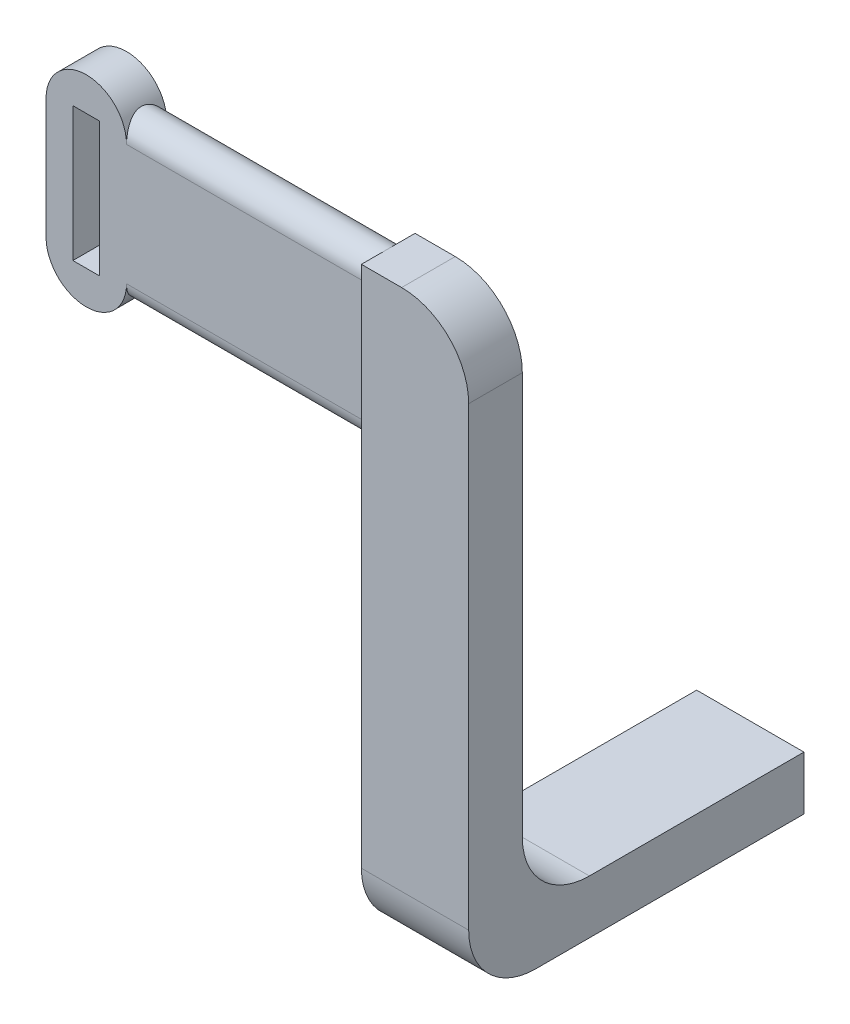
ISO-10303-21;
HEADER;
FILE_DESCRIPTION(('STEP AP214'),'2;1');
FILE_NAME('part.step','',(''),(''),'','','');
FILE_SCHEMA(('AUTOMOTIVE_DESIGN { 1 0 10303 214 1 1 1 1 }'));
ENDSEC;
DATA;
#1=APPLICATION_CONTEXT('core data for automotive mechanical design processes');
#2=APPLICATION_PROTOCOL_DEFINITION('international standard','automotive_design',2000,#1);
#3=PRODUCT_CONTEXT('',#1,'mechanical');
#4=PRODUCT('Part','Part','',(#3));
#5=PRODUCT_RELATED_PRODUCT_CATEGORY('part','',(#4));
#6=PRODUCT_DEFINITION_FORMATION('','',#4);
#7=PRODUCT_DEFINITION_CONTEXT('part definition',#1,'design');
#8=PRODUCT_DEFINITION('design','',#6,#7);
#9=PRODUCT_DEFINITION_SHAPE('','',#8);
#10=(LENGTH_UNIT() NAMED_UNIT(*) SI_UNIT(.MILLI.,.METRE.));
#11=(NAMED_UNIT(*) PLANE_ANGLE_UNIT() SI_UNIT($,.RADIAN.));
#12=(NAMED_UNIT(*) SI_UNIT($,.STERADIAN.) SOLID_ANGLE_UNIT());
#13=UNCERTAINTY_MEASURE_WITH_UNIT(LENGTH_MEASURE(1.E-05),#10,'distance_accuracy_value','');
#14=(GEOMETRIC_REPRESENTATION_CONTEXT(3) GLOBAL_UNCERTAINTY_ASSIGNED_CONTEXT((#13)) GLOBAL_UNIT_ASSIGNED_CONTEXT((#10,
#11,#12)) REPRESENTATION_CONTEXT('',''));
#15=CARTESIAN_POINT('',(0.,0.,0.));
#16=DIRECTION('',(0.,0.,1.));
#17=DIRECTION('',(1.,0.,0.));
#18=AXIS2_PLACEMENT_3D('',#15,#16,#17);
#19=CARTESIAN_POINT('',(-8.,-4.,50.));
#20=DIRECTION('',(0.,1.,0.));
#21=DIRECTION('',(0.,0.,1.));
#22=AXIS2_PLACEMENT_3D('',#19,#20,#21);
#23=PLANE('',#22);
#24=DIRECTION('',(0.,0.,-1.));
#25=VECTOR('',#24,1.);
#26=CARTESIAN_POINT('',(8.,-4.,50.));
#27=LINE('',#26,#25);
#28=CARTESIAN_POINT('',(8.,-4.,40.));
#29=VERTEX_POINT('',#28);
#30=CARTESIAN_POINT('',(8.,-4.,0.));
#31=VERTEX_POINT('',#30);
#32=EDGE_CURVE('E397',#29,#31,#27,.T.);
#33=ORIENTED_EDGE('',*,*,#32,.F.);
#34=DIRECTION('',(1.,0.,0.));
#35=VECTOR('',#34,1.);
#36=CARTESIAN_POINT('',(-8.,-4.,40.));
#37=LINE('',#36,#35);
#38=CARTESIAN_POINT('',(-8.,-4.,40.));
#39=VERTEX_POINT('',#38);
#40=EDGE_CURVE('E383',#29,#39,#37,.F.);
#41=ORIENTED_EDGE('',*,*,#40,.T.);
#42=DIRECTION('',(0.,0.,-1.));
#43=VECTOR('',#42,1.);
#44=CARTESIAN_POINT('',(-8.,-4.,50.));
#45=LINE('',#44,#43);
#46=CARTESIAN_POINT('',(-8.,-4.,0.));
#47=VERTEX_POINT('',#46);
#48=EDGE_CURVE('E394',#39,#47,#45,.T.);
#49=ORIENTED_EDGE('',*,*,#48,.T.);
#50=DIRECTION('',(1.,0.,0.));
#51=VECTOR('',#50,1.);
#52=CARTESIAN_POINT('',(-8.,-4.,0.));
#53=LINE('',#52,#51);
#54=CARTESIAN_POINT('',(-4.,-4.,0.));
#55=VERTEX_POINT('',#54);
#56=EDGE_CURVE('E416',#47,#55,#53,.T.);
#57=ORIENTED_EDGE('',*,*,#56,.T.);
#58=DIRECTION('',(0.,0.,1.));
#59=VECTOR('',#58,1.);
#60=CARTESIAN_POINT('',(-4.,-4.,0.));
#61=LINE('',#60,#59);
#62=CARTESIAN_POINT('',(-4.,-4.,25.));
#63=VERTEX_POINT('',#62);
#64=EDGE_CURVE('E454',#55,#63,#61,.T.);
#65=ORIENTED_EDGE('',*,*,#64,.T.);
#66=DIRECTION('',(1.,0.,0.));
#67=VECTOR('',#66,1.);
#68=CARTESIAN_POINT('',(-4.,-4.,25.));
#69=LINE('',#68,#67);
#70=CARTESIAN_POINT('',(4.,-4.,25.));
#71=VERTEX_POINT('',#70);
#72=EDGE_CURVE('E450',#63,#71,#69,.T.);
#73=ORIENTED_EDGE('',*,*,#72,.T.);
#74=DIRECTION('',(0.,0.,-1.));
#75=VECTOR('',#74,1.);
#76=CARTESIAN_POINT('',(4.,-4.,0.));
#77=LINE('',#76,#75);
#78=CARTESIAN_POINT('',(4.,-4.,0.));
#79=VERTEX_POINT('',#78);
#80=EDGE_CURVE('E445',#71,#79,#77,.T.);
#81=ORIENTED_EDGE('',*,*,#80,.T.);
#82=EDGE_CURVE('E420',#79,#31,#53,.T.);
#83=ORIENTED_EDGE('',*,*,#82,.T.);
#84=EDGE_LOOP('',(#33,#41,#49,#57,#65,#73,#81,#83));
#85=FACE_BOUND('',#84,.T.);
#86=ADVANCED_FACE('F38',(#85),#23,.F.);
#87=CARTESIAN_POINT('',(0.,0.,0.));
#88=DIRECTION('',(0.,0.,1.));
#89=DIRECTION('',(1.,0.,0.));
#90=AXIS2_PLACEMENT_3D('',#87,#88,#89);
#91=PLANE('',#90);
#92=DIRECTION('',(0.,-1.,0.));
#93=VECTOR('',#92,1.);
#94=CARTESIAN_POINT('',(-4.,1.,0.));
#95=LINE('',#94,#93);
#96=CARTESIAN_POINT('',(-4.,1.,0.));
#97=VERTEX_POINT('',#96);
#98=EDGE_CURVE('E440',#97,#55,#95,.T.);
#99=ORIENTED_EDGE('',*,*,#98,.T.);
#100=ORIENTED_EDGE('',*,*,#56,.F.);
#101=DIRECTION('',(0.,-1.,0.));
#102=VECTOR('',#101,1.);
#103=CARTESIAN_POINT('',(-8.,4.,0.));
#104=LINE('',#103,#102);
#105=CARTESIAN_POINT('',(-8.,4.,0.));
#106=VERTEX_POINT('',#105);
#107=EDGE_CURVE('E421',#106,#47,#104,.T.);
#108=ORIENTED_EDGE('',*,*,#107,.F.);
#109=DIRECTION('',(1.,0.,0.));
#110=VECTOR('',#109,1.);
#111=CARTESIAN_POINT('',(-8.,4.,0.));
#112=LINE('',#111,#110);
#113=CARTESIAN_POINT('',(8.,4.,0.));
#114=VERTEX_POINT('',#113);
#115=EDGE_CURVE('E407',#106,#114,#112,.T.);
#116=ORIENTED_EDGE('',*,*,#115,.T.);
#117=DIRECTION('',(0.,-1.,0.));
#118=VECTOR('',#117,1.);
#119=CARTESIAN_POINT('',(8.,4.,0.));
#120=LINE('',#119,#118);
#121=EDGE_CURVE('E412',#114,#31,#120,.T.);
#122=ORIENTED_EDGE('',*,*,#121,.T.);
#123=ORIENTED_EDGE('',*,*,#82,.F.);
#124=DIRECTION('',(0.,-1.,0.));
#125=VECTOR('',#124,1.);
#126=CARTESIAN_POINT('',(4.,1.,0.));
#127=LINE('',#126,#125);
#128=CARTESIAN_POINT('',(4.,1.,0.));
#129=VERTEX_POINT('',#128);
#130=EDGE_CURVE('E437',#129,#79,#127,.T.);
#131=ORIENTED_EDGE('',*,*,#130,.F.);
#132=DIRECTION('',(-1.,0.,0.));
#133=VECTOR('',#132,1.);
#134=CARTESIAN_POINT('',(-4.,1.,0.));
#135=LINE('',#134,#133);
#136=EDGE_CURVE('E444',#129,#97,#135,.T.);
#137=ORIENTED_EDGE('',*,*,#136,.T.);
#138=EDGE_LOOP('',(#99,#100,#108,#116,#122,#123,#131,#137));
#139=FACE_BOUND('',#138,.T.);
#140=ADVANCED_FACE('F325',(#139),#91,.F.);
#141=CARTESIAN_POINT('',(-8.,4.,50.));
#142=DIRECTION('',(1.,0.,0.));
#143=DIRECTION('',(0.,0.,-1.));
#144=AXIS2_PLACEMENT_3D('',#141,#142,#143);
#145=PLANE('',#144);
#146=ORIENTED_EDGE('',*,*,#48,.F.);
#147=CARTESIAN_POINT('',(-8.,6.,40.));
#148=DIRECTION('',(1.,0.,0.));
#149=DIRECTION('',(0.,0.,-1.));
#150=AXIS2_PLACEMENT_3D('',#147,#148,#149);
#151=CIRCLE('',#150,10.);
#152=CARTESIAN_POINT('',(-8.,6.,50.));
#153=VERTEX_POINT('',#152);
#154=EDGE_CURVE('E380',#39,#153,#151,.F.);
#155=ORIENTED_EDGE('',*,*,#154,.T.);
#156=DIRECTION('',(0.,-1.,0.));
#157=VECTOR('',#156,1.);
#158=CARTESIAN_POINT('',(-8.,4.,50.));
#159=LINE('',#158,#157);
#160=CARTESIAN_POINT('',(-8.,84.,50.));
#161=VERTEX_POINT('',#160);
#162=EDGE_CURVE('E411',#161,#153,#159,.T.);
#163=ORIENTED_EDGE('',*,*,#162,.F.);
#164=DIRECTION('',(0.,0.,1.));
#165=VECTOR('',#164,1.);
#166=CARTESIAN_POINT('',(-8.,84.,50.));
#167=LINE('',#166,#165);
#168=CARTESIAN_POINT('',(-8.,84.,46.0252352163252));
#169=VERTEX_POINT('',#168);
#170=EDGE_CURVE('E488',#169,#161,#167,.T.);
#171=ORIENTED_EDGE('',*,*,#170,.F.);
#172=CARTESIAN_POINT('',(-8.,81.,46.0252352163252));
#173=DIRECTION('',(1.,0.,0.));
#174=DIRECTION('',(0.,0.,-1.));
#175=AXIS2_PLACEMENT_3D('',#172,#173,#174);
#176=CIRCLE('',#175,3.);
#177=CARTESIAN_POINT('',(-8.,81.,49.0252352163252));
#178=VERTEX_POINT('',#177);
#179=EDGE_CURVE('E393',#169,#178,#176,.T.);
#180=ORIENTED_EDGE('',*,*,#179,.T.);
#181=DIRECTION('',(0.,-1.,0.));
#182=VECTOR('',#181,1.);
#183=CARTESIAN_POINT('',(-8.,81.,49.0252352163252));
#184=LINE('',#183,#182);
#185=CARTESIAN_POINT('',(-8.,63.,49.0252352163252));
#186=VERTEX_POINT('',#185);
#187=EDGE_CURVE('E509',#178,#186,#184,.T.);
#188=ORIENTED_EDGE('',*,*,#187,.T.);
#189=CARTESIAN_POINT('',(-8.,63.,46.0252352163252));
#190=DIRECTION('',(1.,0.,0.));
#191=DIRECTION('',(0.,0.,-1.));
#192=AXIS2_PLACEMENT_3D('',#189,#190,#191);
#193=CIRCLE('',#192,3.);
#194=CARTESIAN_POINT('',(-8.,63.,43.0252352163252));
#195=VERTEX_POINT('',#194);
#196=EDGE_CURVE('E505',#186,#195,#193,.T.);
#197=ORIENTED_EDGE('',*,*,#196,.T.);
#198=DIRECTION('',(0.,1.,0.));
#199=VECTOR('',#198,1.);
#200=CARTESIAN_POINT('',(-8.,81.,43.0252352163252));
#201=LINE('',#200,#199);
#202=CARTESIAN_POINT('',(-8.,81.,43.0252352163252));
#203=VERTEX_POINT('',#202);
#204=EDGE_CURVE('E493',#195,#203,#201,.T.);
#205=ORIENTED_EDGE('',*,*,#204,.T.);
#206=EDGE_CURVE('E512',#203,#169,#176,.T.);
#207=ORIENTED_EDGE('',*,*,#206,.T.);
#208=CARTESIAN_POINT('',(-8.,84.,42.));
#209=VERTEX_POINT('',#208);
#210=EDGE_CURVE('E484',#209,#169,#167,.T.);
#211=ORIENTED_EDGE('',*,*,#210,.F.);
#212=DIRECTION('',(0.,-1.,0.));
#213=VECTOR('',#212,1.);
#214=CARTESIAN_POINT('',(-8.,84.,42.));
#215=LINE('',#214,#213);
#216=CARTESIAN_POINT('',(-8.,14.,42.));
#217=VERTEX_POINT('',#216);
#218=EDGE_CURVE('E473',#209,#217,#215,.T.);
#219=ORIENTED_EDGE('',*,*,#218,.T.);
#220=CARTESIAN_POINT('',(-8.,14.,32.));
#221=DIRECTION('',(1.,0.,0.));
#222=DIRECTION('',(0.,0.,-1.));
#223=AXIS2_PLACEMENT_3D('',#220,#221,#222);
#224=CIRCLE('',#223,10.);
#225=CARTESIAN_POINT('',(-8.,4.,32.));
#226=VERTEX_POINT('',#225);
#227=EDGE_CURVE('E365',#217,#226,#224,.T.);
#228=ORIENTED_EDGE('',*,*,#227,.T.);
#229=DIRECTION('',(0.,0.,-1.));
#230=VECTOR('',#229,1.);
#231=CARTESIAN_POINT('',(-8.,4.,50.));
#232=LINE('',#231,#230);
#233=EDGE_CURVE('E403',#226,#106,#232,.T.);
#234=ORIENTED_EDGE('',*,*,#233,.T.);
#235=ORIENTED_EDGE('',*,*,#107,.T.);
#236=EDGE_LOOP('',(#146,#155,#163,#171,#180,#188,#197,#205,#207,#211,#219,#228,#234,#235));
#237=FACE_BOUND('',#236,.T.);
#238=ADVANCED_FACE('F333',(#237),#145,.F.);
#239=CARTESIAN_POINT('',(8.,4.,50.));
#240=DIRECTION('',(1.,0.,0.));
#241=DIRECTION('',(0.,0.,-1.));
#242=AXIS2_PLACEMENT_3D('',#239,#240,#241);
#243=PLANE('',#242);
#244=DIRECTION('',(0.,-1.,0.));
#245=VECTOR('',#244,1.);
#246=CARTESIAN_POINT('',(8.,84.,42.));
#247=LINE('',#246,#245);
#248=CARTESIAN_POINT('',(8.,74.,42.));
#249=VERTEX_POINT('',#248);
#250=CARTESIAN_POINT('',(8.,14.,42.));
#251=VERTEX_POINT('',#250);
#252=EDGE_CURVE('E458',#249,#251,#247,.T.);
#253=ORIENTED_EDGE('',*,*,#252,.F.);
#254=DIRECTION('',(0.,0.,-1.));
#255=VECTOR('',#254,1.);
#256=CARTESIAN_POINT('',(8.,74.,50.));
#257=LINE('',#256,#255);
#258=CARTESIAN_POINT('',(8.,74.,50.));
#259=VERTEX_POINT('',#258);
#260=EDGE_CURVE('E47',#249,#259,#257,.F.);
#261=ORIENTED_EDGE('',*,*,#260,.T.);
#262=DIRECTION('',(0.,-1.,0.));
#263=VECTOR('',#262,1.);
#264=CARTESIAN_POINT('',(8.,4.,50.));
#265=LINE('',#264,#263);
#266=CARTESIAN_POINT('',(8.,6.,50.));
#267=VERTEX_POINT('',#266);
#268=EDGE_CURVE('E406',#259,#267,#265,.T.);
#269=ORIENTED_EDGE('',*,*,#268,.T.);
#270=CARTESIAN_POINT('',(8.,6.,40.));
#271=DIRECTION('',(1.,0.,0.));
#272=DIRECTION('',(0.,0.,-1.));
#273=AXIS2_PLACEMENT_3D('',#270,#271,#272);
#274=CIRCLE('',#273,10.);
#275=EDGE_CURVE('E386',#267,#29,#274,.T.);
#276=ORIENTED_EDGE('',*,*,#275,.T.);
#277=ORIENTED_EDGE('',*,*,#32,.T.);
#278=ORIENTED_EDGE('',*,*,#121,.F.);
#279=DIRECTION('',(0.,0.,-1.));
#280=VECTOR('',#279,1.);
#281=CARTESIAN_POINT('',(8.,4.,50.));
#282=LINE('',#281,#280);
#283=CARTESIAN_POINT('',(8.,4.,32.));
#284=VERTEX_POINT('',#283);
#285=EDGE_CURVE('E400',#284,#114,#282,.T.);
#286=ORIENTED_EDGE('',*,*,#285,.F.);
#287=CARTESIAN_POINT('',(8.,14.,32.));
#288=DIRECTION('',(1.,0.,0.));
#289=DIRECTION('',(0.,0.,-1.));
#290=AXIS2_PLACEMENT_3D('',#287,#288,#289);
#291=CIRCLE('',#290,10.);
#292=EDGE_CURVE('E358',#284,#251,#291,.F.);
#293=ORIENTED_EDGE('',*,*,#292,.T.);
#294=EDGE_LOOP('',(#253,#261,#269,#276,#277,#278,#286,#293));
#295=FACE_BOUND('',#294,.T.);
#296=ADVANCED_FACE('F339',(#295),#243,.T.);
#297=CARTESIAN_POINT('',(-8.,4.,50.));
#298=DIRECTION('',(0.,1.,0.));
#299=DIRECTION('',(0.,0.,1.));
#300=AXIS2_PLACEMENT_3D('',#297,#298,#299);
#301=PLANE('',#300);
#302=ORIENTED_EDGE('',*,*,#233,.F.);
#303=DIRECTION('',(-1.,0.,0.));
#304=VECTOR('',#303,1.);
#305=CARTESIAN_POINT('',(-8.,4.,32.));
#306=LINE('',#305,#304);
#307=EDGE_CURVE('E359',#226,#284,#306,.F.);
#308=ORIENTED_EDGE('',*,*,#307,.T.);
#309=ORIENTED_EDGE('',*,*,#285,.T.);
#310=ORIENTED_EDGE('',*,*,#115,.F.);
#311=EDGE_LOOP('',(#302,#308,#309,#310));
#312=FACE_BOUND('',#311,.T.);
#313=ADVANCED_FACE('F570',(#312),#301,.T.);
#314=CARTESIAN_POINT('',(0.,0.,50.));
#315=DIRECTION('',(0.,0.,1.));
#316=DIRECTION('',(1.,0.,0.));
#317=AXIS2_PLACEMENT_3D('',#314,#315,#316);
#318=PLANE('',#317);
#319=ORIENTED_EDGE('',*,*,#268,.F.);
#320=CARTESIAN_POINT('',(-2.,74.,50.));
#321=DIRECTION('',(0.,0.,1.));
#322=DIRECTION('',(1.,0.,0.));
#323=AXIS2_PLACEMENT_3D('',#320,#321,#322);
#324=CIRCLE('',#323,10.);
#325=CARTESIAN_POINT('',(-2.,84.,50.));
#326=VERTEX_POINT('',#325);
#327=EDGE_CURVE('E11',#259,#326,#324,.T.);
#328=ORIENTED_EDGE('',*,*,#327,.T.);
#329=DIRECTION('',(1.,0.,0.));
#330=VECTOR('',#329,1.);
#331=CARTESIAN_POINT('',(-8.,84.,50.));
#332=LINE('',#331,#330);
#333=EDGE_CURVE('E480',#161,#326,#332,.T.);
#334=ORIENTED_EDGE('',*,*,#333,.F.);
#335=ORIENTED_EDGE('',*,*,#162,.T.);
#336=DIRECTION('',(1.,0.,0.));
#337=VECTOR('',#336,1.);
#338=CARTESIAN_POINT('',(8.,6.,50.));
#339=LINE('',#338,#337);
#340=EDGE_CURVE('E389',#153,#267,#339,.T.);
#341=ORIENTED_EDGE('',*,*,#340,.T.);
#342=EDGE_LOOP('',(#319,#328,#334,#335,#341));
#343=FACE_BOUND('',#342,.T.);
#344=ADVANCED_FACE('F567',(#343),#318,.T.);
#345=CARTESIAN_POINT('',(-4.,1.,0.));
#346=DIRECTION('',(1.,0.,0.));
#347=DIRECTION('',(0.,0.,-1.));
#348=AXIS2_PLACEMENT_3D('',#345,#346,#347);
#349=PLANE('',#348);
#350=ORIENTED_EDGE('',*,*,#64,.F.);
#351=ORIENTED_EDGE('',*,*,#98,.F.);
#352=DIRECTION('',(0.,0.,1.));
#353=VECTOR('',#352,1.);
#354=CARTESIAN_POINT('',(-4.,1.,0.));
#355=LINE('',#354,#353);
#356=CARTESIAN_POINT('',(-4.,1.,25.));
#357=VERTEX_POINT('',#356);
#358=EDGE_CURVE('E449',#97,#357,#355,.T.);
#359=ORIENTED_EDGE('',*,*,#358,.T.);
#360=DIRECTION('',(0.,-1.,0.));
#361=VECTOR('',#360,1.);
#362=CARTESIAN_POINT('',(-4.,1.,25.));
#363=LINE('',#362,#361);
#364=EDGE_CURVE('E425',#357,#63,#363,.T.);
#365=ORIENTED_EDGE('',*,*,#364,.T.);
#366=EDGE_LOOP('',(#350,#351,#359,#365));
#367=FACE_BOUND('',#366,.T.);
#368=ADVANCED_FACE('F563',(#367),#349,.T.);
#369=CARTESIAN_POINT('',(-4.,1.,25.));
#370=DIRECTION('',(0.,0.,-1.));
#371=DIRECTION('',(-1.,0.,0.));
#372=AXIS2_PLACEMENT_3D('',#369,#370,#371);
#373=PLANE('',#372);
#374=ORIENTED_EDGE('',*,*,#72,.F.);
#375=ORIENTED_EDGE('',*,*,#364,.F.);
#376=DIRECTION('',(1.,0.,0.));
#377=VECTOR('',#376,1.);
#378=CARTESIAN_POINT('',(-4.,1.,25.));
#379=LINE('',#378,#377);
#380=CARTESIAN_POINT('',(4.,1.,25.));
#381=VERTEX_POINT('',#380);
#382=EDGE_CURVE('E465',#357,#381,#379,.T.);
#383=ORIENTED_EDGE('',*,*,#382,.T.);
#384=DIRECTION('',(0.,-1.,0.));
#385=VECTOR('',#384,1.);
#386=CARTESIAN_POINT('',(4.,1.,25.));
#387=LINE('',#386,#385);
#388=EDGE_CURVE('E434',#381,#71,#387,.T.);
#389=ORIENTED_EDGE('',*,*,#388,.T.);
#390=EDGE_LOOP('',(#374,#375,#383,#389));
#391=FACE_BOUND('',#390,.T.);
#392=ADVANCED_FACE('F559',(#391),#373,.T.);
#393=CARTESIAN_POINT('',(4.,1.,0.));
#394=DIRECTION('',(-1.,0.,0.));
#395=DIRECTION('',(0.,0.,1.));
#396=AXIS2_PLACEMENT_3D('',#393,#394,#395);
#397=PLANE('',#396);
#398=ORIENTED_EDGE('',*,*,#80,.F.);
#399=ORIENTED_EDGE('',*,*,#388,.F.);
#400=DIRECTION('',(0.,0.,-1.));
#401=VECTOR('',#400,1.);
#402=CARTESIAN_POINT('',(4.,1.,0.));
#403=LINE('',#402,#401);
#404=EDGE_CURVE('E462',#381,#129,#403,.T.);
#405=ORIENTED_EDGE('',*,*,#404,.T.);
#406=ORIENTED_EDGE('',*,*,#130,.T.);
#407=EDGE_LOOP('',(#398,#399,#405,#406));
#408=FACE_BOUND('',#407,.T.);
#409=ADVANCED_FACE('F555',(#408),#397,.T.);
#410=CARTESIAN_POINT('',(0.,1.,0.));
#411=DIRECTION('',(0.,1.,0.));
#412=DIRECTION('',(0.,0.,1.));
#413=AXIS2_PLACEMENT_3D('',#410,#411,#412);
#414=PLANE('',#413);
#415=ORIENTED_EDGE('',*,*,#358,.F.);
#416=ORIENTED_EDGE('',*,*,#136,.F.);
#417=ORIENTED_EDGE('',*,*,#404,.F.);
#418=ORIENTED_EDGE('',*,*,#382,.F.);
#419=EDGE_LOOP('',(#415,#416,#417,#418));
#420=FACE_BOUND('',#419,.T.);
#421=ADVANCED_FACE('F550',(#420),#414,.F.);
#422=CARTESIAN_POINT('',(-8.,84.,42.));
#423=DIRECTION('',(0.,0.,1.));
#424=DIRECTION('',(1.,0.,0.));
#425=AXIS2_PLACEMENT_3D('',#422,#423,#424);
#426=PLANE('',#425);
#427=DIRECTION('',(-1.,0.,0.));
#428=VECTOR('',#427,1.);
#429=CARTESIAN_POINT('',(-8.,84.,42.));
#430=LINE('',#429,#428);
#431=CARTESIAN_POINT('',(-2.,84.,42.));
#432=VERTEX_POINT('',#431);
#433=EDGE_CURVE('E477',#432,#209,#430,.T.);
#434=ORIENTED_EDGE('',*,*,#433,.F.);
#435=CARTESIAN_POINT('',(-2.,74.,42.));
#436=DIRECTION('',(0.,0.,1.));
#437=DIRECTION('',(1.,0.,0.));
#438=AXIS2_PLACEMENT_3D('',#435,#436,#437);
#439=CIRCLE('',#438,10.);
#440=EDGE_CURVE('E61',#432,#249,#439,.F.);
#441=ORIENTED_EDGE('',*,*,#440,.T.);
#442=ORIENTED_EDGE('',*,*,#252,.T.);
#443=DIRECTION('',(-1.,0.,0.));
#444=VECTOR('',#443,1.);
#445=CARTESIAN_POINT('',(-8.,14.,42.));
#446=LINE('',#445,#444);
#447=EDGE_CURVE('E361',#251,#217,#446,.T.);
#448=ORIENTED_EDGE('',*,*,#447,.T.);
#449=ORIENTED_EDGE('',*,*,#218,.F.);
#450=EDGE_LOOP('',(#434,#441,#442,#448,#449));
#451=FACE_BOUND('',#450,.T.);
#452=ADVANCED_FACE('F545',(#451),#426,.F.);
#453=CARTESIAN_POINT('',(0.,84.,0.));
#454=DIRECTION('',(0.,-1.,0.));
#455=DIRECTION('',(0.,0.,-1.));
#456=AXIS2_PLACEMENT_3D('',#453,#454,#455);
#457=PLANE('',#456);
#458=ORIENTED_EDGE('',*,*,#333,.T.);
#459=DIRECTION('',(0.,0.,-1.));
#460=VECTOR('',#459,1.);
#461=CARTESIAN_POINT('',(-2.,84.,42.));
#462=LINE('',#461,#460);
#463=EDGE_CURVE('E364',#326,#432,#462,.T.);
#464=ORIENTED_EDGE('',*,*,#463,.T.);
#465=ORIENTED_EDGE('',*,*,#433,.T.);
#466=ORIENTED_EDGE('',*,*,#210,.T.);
#467=ORIENTED_EDGE('',*,*,#170,.T.);
#468=EDGE_LOOP('',(#458,#464,#465,#466,#467));
#469=FACE_BOUND('',#468,.T.);
#470=ADVANCED_FACE('F540',(#469),#457,.F.);
#471=CARTESIAN_POINT('',(-50.,81.,46.0252352163252));
#472=DIRECTION('',(1.,0.,0.));
#473=DIRECTION('',(0.,0.,-1.));
#474=AXIS2_PLACEMENT_3D('',#471,#472,#473);
#475=CYLINDRICAL_SURFACE('',#474,3.);
#476=CARTESIAN_POINT('',(-44.,81.,49.0252352163252));
#477=CARTESIAN_POINT('',(-43.9999859431479,81.0791935142297,49.0252479384075));
#478=CARTESIAN_POINT('',(-44.0015675297775,81.1583780145098,49.0220997677143));
#479=CARTESIAN_POINT('',(-44.0078165302508,81.3161000322899,49.0095804589669));
#480=CARTESIAN_POINT('',(-44.0124827048766,81.3946377967895,49.0002118199485));
#481=CARTESIAN_POINT('',(-44.0247677991761,81.5501502962676,48.9754063372397));
#482=CARTESIAN_POINT('',(-44.0323733005401,81.6271304849032,48.9599970651046));
#483=CARTESIAN_POINT('',(-44.050333983838,81.7793311504577,48.9232999267121));
#484=CARTESIAN_POINT('',(-44.0606893360922,81.8545515180625,48.9020116963204));
#485=CARTESIAN_POINT('',(-44.0954923956325,82.0766331266901,48.8297003930256));
#486=CARTESIAN_POINT('',(-44.1237044726322,82.2202415444621,48.7701776285063));
#487=CARTESIAN_POINT('',(-44.1875897942736,82.4952986333516,48.630605102608));
#488=CARTESIAN_POINT('',(-44.2232704888868,82.62673497251,48.5505348268576));
#489=CARTESIAN_POINT('',(-44.3013141653527,82.8825243880921,48.3666778844016));
#490=CARTESIAN_POINT('',(-44.343949585787,83.005979756186,48.2617567701608));
#491=CARTESIAN_POINT('',(-44.4302043046155,83.2343479629372,48.0336660654038));
#492=CARTESIAN_POINT('',(-44.4738242286276,83.3392486139634,47.9104845775014));
#493=CARTESIAN_POINT('',(-44.5610370247465,83.5357691085504,47.6377493036384));
#494=CARTESIAN_POINT('',(-44.6043650018186,83.625726122175,47.4868906611134));
#495=CARTESIAN_POINT('',(-44.6621766031388,83.7403425096584,47.2492795170383));
#496=CARTESIAN_POINT('',(-44.6802551254187,83.7751694774002,47.1681603473567));
#497=CARTESIAN_POINT('',(-44.7133426790783,83.837693648472,47.0026325954009));
#498=CARTESIAN_POINT('',(-44.72835352373,83.8653950661595,46.918225991631));
#499=CARTESIAN_POINT('',(-44.753896441964,83.9118825502262,46.7518403383498));
#500=CARTESIAN_POINT('',(-44.764641369412,83.9310999857977,46.6700142854117));
#501=CARTESIAN_POINT('',(-44.7824217957381,83.9626349532063,46.50468409217));
#502=CARTESIAN_POINT('',(-44.7894592622443,83.9749561452434,46.4211808664565));
#503=CARTESIAN_POINT('',(-44.7995222379909,83.9925134854643,46.2532336453543));
#504=CARTESIAN_POINT('',(-44.8025500726916,83.9977537404051,46.1687902239338));
#505=CARTESIAN_POINT('',(-44.8044744656262,84.0010845687883,45.9997434879581));
#506=CARTESIAN_POINT('',(-44.8033714179793,83.9991758243024,45.9151401894261));
#507=CARTESIAN_POINT('',(-44.7946532579833,83.9840496231326,45.6824797096819));
#508=CARTESIAN_POINT('',(-44.7827317920057,83.9633499383315,45.5349878544878));
#509=CARTESIAN_POINT('',(-44.747717680128,83.9008219313133,45.2460384793637));
#510=CARTESIAN_POINT('',(-44.7246217172793,83.8589873354144,45.1045827647292));
#511=CARTESIAN_POINT('',(-44.669374683477,83.7546290239842,44.8275574620023));
#512=CARTESIAN_POINT('',(-44.6370252478153,83.6916461531877,44.6922016892961));
#513=CARTESIAN_POINT('',(-44.5668993438709,83.547128109023,44.4333338277885));
#514=CARTESIAN_POINT('',(-44.5291202917953,83.4655840921107,44.3098274246774));
#515=CARTESIAN_POINT('',(-44.4466062712288,83.2741988994997,44.061675500843));
#516=CARTESIAN_POINT('',(-44.4015965734467,83.1620811344713,43.9388696977154));
#517=CARTESIAN_POINT('',(-44.3135748604432,82.9186840220664,43.7130378131103));
#518=CARTESIAN_POINT('',(-44.270563933257,82.7873943958445,43.6100224111426));
#519=CARTESIAN_POINT('',(-44.188915831116,82.5014395781279,43.4221191874112));
#520=CARTESIAN_POINT('',(-44.150578687564,82.3459664705608,43.3383091183642));
#521=CARTESIAN_POINT('',(-44.101545297718,82.1023344880908,43.2336956097981));
#522=CARTESIAN_POINT('',(-44.0866156171957,82.019409251829,43.2023466801408));
#523=CARTESIAN_POINT('',(-44.0599936844942,81.8506519668071,43.1469948253656));
#524=CARTESIAN_POINT('',(-44.0483003357333,81.7648209137294,43.1229894117182));
#525=CARTESIAN_POINT('',(-44.0258501306411,81.567344267642,43.0771892603574));
#526=CARTESIAN_POINT('',(-44.0162055407133,81.4550056151374,43.0577559816359));
#527=CARTESIAN_POINT('',(-44.0065098677314,81.2851510658708,43.0382717537498));
#528=CARTESIAN_POINT('',(-44.0040731526787,81.2282756210178,43.033387936717));
#529=CARTESIAN_POINT('',(-44.0008169847668,81.1142727509983,43.0268687591504));
#530=CARTESIAN_POINT('',(-43.9999981021824,81.0571452440906,43.0252345440777));
#531=CARTESIAN_POINT('',(-44.,81.,43.0252352163252));
#532=B_SPLINE_CURVE_WITH_KNOTS('',3,(#476,#477,#478,#479,#480,#481,#482,#483,#484,#485,#486,
#487,#488,#489,#490,#491,#492,#493,#494,#495,#496,#497,#498,#499,#500,#501,#502,#503,#504,#505,
#506,#507,#508,#509,#510,#511,#512,#513,#514,#515,#516,#517,#518,#519,#520,#521,#522,#523,#524,
#525,#526,#527,#528,#529,#530,#531),.UNSPECIFIED.,.F.,.F.,(4,2,2,2,2,2,2,2,2,2,2,2,2,2,2,2,2,2,
2,2,2,2,2,2,2,2,2,4),(0.,0.23748722121864,0.474879091057443,0.71119980681767,0.94753516323445,
1.41922222141813,1.89138205060135,2.39186200163888,2.89266948097725,3.43234898408421,
3.70236462751273,3.97222020293529,4.2260685194832,4.47978197727261,4.73334822469419,
4.98689028048522,5.43282575429976,5.87889367733417,6.33535046902727,6.79202519860241,
7.30658195029048,7.8214155974475,8.36041301194786,8.62977435146565,8.89904430994226,
9.24127553351258,9.4125867286648,9.5839582990632),.UNSPECIFIED.);
#533=CARTESIAN_POINT('',(-44.,81.,49.0252352163253));
#534=VERTEX_POINT('',#533);
#535=CARTESIAN_POINT('',(-44.,81.,43.0252352163253));
#536=VERTEX_POINT('',#535);
#537=EDGE_CURVE('E276',#534,#536,#532,.T.);
#538=ORIENTED_EDGE('',*,*,#537,.F.);
#539=DIRECTION('',(1.,0.,0.));
#540=VECTOR('',#539,1.);
#541=CARTESIAN_POINT('',(-50.,81.,49.0252352163252));
#542=LINE('',#541,#540);
#543=EDGE_CURVE('E489',#534,#178,#542,.T.);
#544=ORIENTED_EDGE('',*,*,#543,.T.);
#545=ORIENTED_EDGE('',*,*,#179,.F.);
#546=ORIENTED_EDGE('',*,*,#206,.F.);
#547=DIRECTION('',(1.,0.,0.));
#548=VECTOR('',#547,1.);
#549=CARTESIAN_POINT('',(-50.,81.,43.0252352163252));
#550=LINE('',#549,#548);
#551=EDGE_CURVE('E499',#536,#203,#550,.T.);
#552=ORIENTED_EDGE('',*,*,#551,.F.);
#553=EDGE_LOOP('',(#538,#544,#545,#546,#552));
#554=FACE_BOUND('',#553,.T.);
#555=ADVANCED_FACE('F295',(#554),#475,.T.);
#556=CARTESIAN_POINT('',(-50.,81.,43.0252352163252));
#557=DIRECTION('',(0.,0.,-1.));
#558=DIRECTION('',(-1.,0.,0.));
#559=AXIS2_PLACEMENT_3D('',#556,#557,#558);
#560=PLANE('',#559);
#561=DIRECTION('',(1.,0.,0.));
#562=VECTOR('',#561,1.);
#563=CARTESIAN_POINT('',(-52.,82.,43.0252352163252));
#564=LINE('',#563,#562);
#565=CARTESIAN_POINT('',(-52.,82.,43.0252352163252));
#566=VERTEX_POINT('',#565);
#567=CARTESIAN_POINT('',(-48.,82.,43.0252352163252));
#568=VERTEX_POINT('',#567);
#569=EDGE_CURVE('E202',#566,#568,#564,.T.);
#570=ORIENTED_EDGE('',*,*,#569,.F.);
#571=DIRECTION('',(0.,-1.,0.));
#572=VECTOR('',#571,1.);
#573=CARTESIAN_POINT('',(-52.,82.,43.0252352163252));
#574=LINE('',#573,#572);
#575=CARTESIAN_POINT('',(-52.,62.,43.0252352163252));
#576=VERTEX_POINT('',#575);
#577=EDGE_CURVE('E222',#566,#576,#574,.T.);
#578=ORIENTED_EDGE('',*,*,#577,.T.);
#579=DIRECTION('',(1.,0.,0.));
#580=VECTOR('',#579,1.);
#581=CARTESIAN_POINT('',(-52.,62.,43.0252352163252));
#582=LINE('',#581,#580);
#583=CARTESIAN_POINT('',(-48.,62.,43.0252352163252));
#584=VERTEX_POINT('',#583);
#585=EDGE_CURVE('E226',#576,#584,#582,.T.);
#586=ORIENTED_EDGE('',*,*,#585,.T.);
#587=DIRECTION('',(0.,-1.,0.));
#588=VECTOR('',#587,1.);
#589=CARTESIAN_POINT('',(-48.,82.,43.0252352163252));
#590=LINE('',#589,#588);
#591=EDGE_CURVE('E235',#568,#584,#590,.T.);
#592=ORIENTED_EDGE('',*,*,#591,.F.);
#593=EDGE_LOOP('',(#570,#578,#586,#592));
#594=FACE_BOUND('',#593,.T.);
#595=CARTESIAN_POINT('',(-50.,81.,43.0252352163253));
#596=DIRECTION('',(0.,0.,-1.));
#597=DIRECTION('',(0.,1.,0.));
#598=AXIS2_PLACEMENT_3D('',#595,#596,#597);
#599=CIRCLE('',#598,6.);
#600=CARTESIAN_POINT('',(-56.,81.,43.0252352163253));
#601=VERTEX_POINT('',#600);
#602=EDGE_CURVE('E255',#601,#536,#599,.T.);
#603=ORIENTED_EDGE('',*,*,#602,.T.);
#604=ORIENTED_EDGE('',*,*,#551,.T.);
#605=ORIENTED_EDGE('',*,*,#204,.F.);
#606=DIRECTION('',(1.,0.,0.));
#607=VECTOR('',#606,1.);
#608=CARTESIAN_POINT('',(-50.,63.,43.0252352163252));
#609=LINE('',#608,#607);
#610=CARTESIAN_POINT('',(-44.,63.,43.0252352163253));
#611=VERTEX_POINT('',#610);
#612=EDGE_CURVE('E496',#611,#195,#609,.T.);
#613=ORIENTED_EDGE('',*,*,#612,.F.);
#614=CARTESIAN_POINT('',(-50.,63.,43.0252352163253));
#615=DIRECTION('',(0.,0.,-1.));
#616=DIRECTION('',(0.,1.,0.));
#617=AXIS2_PLACEMENT_3D('',#614,#615,#616);
#618=CIRCLE('',#617,6.);
#619=CARTESIAN_POINT('',(-56.,63.,43.0252352163253));
#620=VERTEX_POINT('',#619);
#621=EDGE_CURVE('E244',#611,#620,#618,.T.);
#622=ORIENTED_EDGE('',*,*,#621,.T.);
#623=DIRECTION('',(0.,1.,0.));
#624=VECTOR('',#623,1.);
#625=CARTESIAN_POINT('',(-56.,63.,43.0252352163253));
#626=LINE('',#625,#624);
#627=EDGE_CURVE('E266',#620,#601,#626,.T.);
#628=ORIENTED_EDGE('',*,*,#627,.T.);
#629=EDGE_LOOP('',(#603,#604,#605,#613,#622,#628));
#630=FACE_BOUND('',#629,.T.);
#631=ADVANCED_FACE('F314',(#594,#630),#560,.T.);
#632=CARTESIAN_POINT('',(-50.,63.,46.0252352163252));
#633=DIRECTION('',(1.,0.,0.));
#634=DIRECTION('',(0.,0.,-1.));
#635=AXIS2_PLACEMENT_3D('',#632,#633,#634);
#636=CYLINDRICAL_SURFACE('',#635,3.);
#637=CARTESIAN_POINT('',(-44.,63.,43.0252352163252));
#638=CARTESIAN_POINT('',(-43.9999859431479,62.9208064857703,43.0252224942429));
#639=CARTESIAN_POINT('',(-44.0015675297775,62.8416219854902,43.0283706649362));
#640=CARTESIAN_POINT('',(-44.0078165302508,62.6838999677101,43.0408899736836));
#641=CARTESIAN_POINT('',(-44.0124827048766,62.6053622032105,43.050258612702));
#642=CARTESIAN_POINT('',(-44.0247677991761,62.4498497037324,43.0750640954107));
#643=CARTESIAN_POINT('',(-44.0323733005401,62.3728695150968,43.0904733675459));
#644=CARTESIAN_POINT('',(-44.050333983838,62.2206688495423,43.1271705059384));
#645=CARTESIAN_POINT('',(-44.0606893360922,62.1454484819375,43.1484587363301));
#646=CARTESIAN_POINT('',(-44.0954923956325,61.9233668733099,43.2207700396249));
#647=CARTESIAN_POINT('',(-44.1237044726322,61.7797584555379,43.2802928041442));
#648=CARTESIAN_POINT('',(-44.1875897942736,61.5047013666484,43.4198653300425));
#649=CARTESIAN_POINT('',(-44.2232704888868,61.37326502749,43.4999356057929));
#650=CARTESIAN_POINT('',(-44.3013141653527,61.1174756119079,43.6837925482489));
#651=CARTESIAN_POINT('',(-44.343949585787,60.994020243814,43.7887136624897));
#652=CARTESIAN_POINT('',(-44.4302043046155,60.7656520370628,44.0168043672467));
#653=CARTESIAN_POINT('',(-44.4738242286276,60.6607513860366,44.1399858551491));
#654=CARTESIAN_POINT('',(-44.5610370247465,60.4642308914496,44.4127211290121));
#655=CARTESIAN_POINT('',(-44.6043650018186,60.374273877825,44.5635797715371));
#656=CARTESIAN_POINT('',(-44.6621766031388,60.2596574903416,44.8011909156122));
#657=CARTESIAN_POINT('',(-44.6802551254187,60.2248305225998,44.8823100852938));
#658=CARTESIAN_POINT('',(-44.7133426790783,60.162306351528,45.0478378372495));
#659=CARTESIAN_POINT('',(-44.72835352373,60.1346049338405,45.1322444410195));
#660=CARTESIAN_POINT('',(-44.753896441964,60.0881174497738,45.2986300943007));
#661=CARTESIAN_POINT('',(-44.7646413694121,60.0689000142023,45.3804561472388));
#662=CARTESIAN_POINT('',(-44.7824217957381,60.0373650467937,45.5457863404805));
#663=CARTESIAN_POINT('',(-44.7894592622443,60.0250438547566,45.629289566194));
#664=CARTESIAN_POINT('',(-44.7995222379909,60.0074865145357,45.7972367872962));
#665=CARTESIAN_POINT('',(-44.8025500726916,60.0022462595949,45.8816802087166));
#666=CARTESIAN_POINT('',(-44.8044744656262,59.9989154312117,46.0507269446924));
#667=CARTESIAN_POINT('',(-44.8033714179793,60.0008241756977,46.1353302432244));
#668=CARTESIAN_POINT('',(-44.7946532579833,60.0159503768674,46.3679907229685));
#669=CARTESIAN_POINT('',(-44.7827317920057,60.0366500616685,46.5154825781626));
#670=CARTESIAN_POINT('',(-44.747717680128,60.0991780686867,46.8044319532867));
#671=CARTESIAN_POINT('',(-44.7246217172793,60.1410126645856,46.9458876679213));
#672=CARTESIAN_POINT('',(-44.669374683477,60.2453709760158,47.2229129706482));
#673=CARTESIAN_POINT('',(-44.6370252478153,60.3083538468123,47.3582687433544));
#674=CARTESIAN_POINT('',(-44.5668993438709,60.452871890977,47.6171366048619));
#675=CARTESIAN_POINT('',(-44.5291202917953,60.5344159078893,47.7406430079731));
#676=CARTESIAN_POINT('',(-44.4466062712288,60.7258011005003,47.9887949318074));
#677=CARTESIAN_POINT('',(-44.4015965734467,60.8379188655287,48.1116007349351));
#678=CARTESIAN_POINT('',(-44.3135748604432,61.0813159779336,48.3374326195402));
#679=CARTESIAN_POINT('',(-44.270563933257,61.2126056041555,48.4404480215078));
#680=CARTESIAN_POINT('',(-44.188915831116,61.4985604218721,48.6283512452392));
#681=CARTESIAN_POINT('',(-44.150578687564,61.6540335294392,48.7121613142862));
#682=CARTESIAN_POINT('',(-44.101545297718,61.8976655119092,48.8167748228523));
#683=CARTESIAN_POINT('',(-44.0866156171957,61.980590748171,48.8481237525097));
#684=CARTESIAN_POINT('',(-44.0599936844942,62.1493480331929,48.9034756072848));
#685=CARTESIAN_POINT('',(-44.0483003357333,62.2351790862706,48.9274810209323));
#686=CARTESIAN_POINT('',(-44.0258501306411,62.4326557323581,48.9732811722931));
#687=CARTESIAN_POINT('',(-44.0162055407133,62.5449943848626,48.9927144510145));
#688=CARTESIAN_POINT('',(-44.0065098677314,62.7148489341292,49.0121986789007));
#689=CARTESIAN_POINT('',(-44.0040731526787,62.7717243789822,49.0170824959335));
#690=CARTESIAN_POINT('',(-44.0008169847668,62.8857272490017,49.0236016735));
#691=CARTESIAN_POINT('',(-43.9999981021824,62.9428547559094,49.0252358885728));
#692=CARTESIAN_POINT('',(-44.,63.,49.0252352163252));
#693=B_SPLINE_CURVE_WITH_KNOTS('',3,(#637,#638,#639,#640,#641,#642,#643,#644,#645,#646,#647,
#648,#649,#650,#651,#652,#653,#654,#655,#656,#657,#658,#659,#660,#661,#662,#663,#664,#665,#666,
#667,#668,#669,#670,#671,#672,#673,#674,#675,#676,#677,#678,#679,#680,#681,#682,#683,#684,#685,
#686,#687,#688,#689,#690,#691,#692),.UNSPECIFIED.,.F.,.F.,(4,2,2,2,2,2,2,2,2,2,2,2,2,2,2,2,2,2,
2,2,2,2,2,2,2,2,2,4),(0.,0.23748722121864,0.474879091057443,0.711199806817685,0.94753516323445,
1.41922222141815,1.89138205060135,2.39186200163888,2.89266948097726,3.43234898408421,
3.70236462751273,3.9722202029353,4.22606851948323,4.47978197727261,4.73334822469419,
4.98689028048521,5.43282575429974,5.87889367733417,6.33535046902726,6.7920251986024,
7.30658195029047,7.82141559744749,8.36041301194784,8.62977435146565,8.89904430994226,
9.24127553351258,9.4125867286648,9.5839582990632),.UNSPECIFIED.);
#694=CARTESIAN_POINT('',(-44.,63.,49.0252352163253));
#695=VERTEX_POINT('',#694);
#696=EDGE_CURVE('E287',#611,#695,#693,.T.);
#697=ORIENTED_EDGE('',*,*,#696,.F.);
#698=ORIENTED_EDGE('',*,*,#612,.T.);
#699=ORIENTED_EDGE('',*,*,#196,.F.);
#700=DIRECTION('',(1.,0.,0.));
#701=VECTOR('',#700,1.);
#702=CARTESIAN_POINT('',(-50.,63.,49.0252352163252));
#703=LINE('',#702,#701);
#704=EDGE_CURVE('E492',#695,#186,#703,.T.);
#705=ORIENTED_EDGE('',*,*,#704,.F.);
#706=EDGE_LOOP('',(#697,#698,#699,#705));
#707=FACE_BOUND('',#706,.T.);
#708=ADVANCED_FACE('F316',(#707),#636,.T.);
#709=CARTESIAN_POINT('',(-50.,81.,49.0252352163252));
#710=DIRECTION('',(0.,0.,1.));
#711=DIRECTION('',(1.,0.,0.));
#712=AXIS2_PLACEMENT_3D('',#709,#710,#711);
#713=PLANE('',#712);
#714=DIRECTION('',(1.,0.,0.));
#715=VECTOR('',#714,1.);
#716=CARTESIAN_POINT('',(-52.,82.,49.0252352163252));
#717=LINE('',#716,#715);
#718=CARTESIAN_POINT('',(-52.,82.,49.0252352163252));
#719=VERTEX_POINT('',#718);
#720=CARTESIAN_POINT('',(-48.,82.,49.0252352163252));
#721=VERTEX_POINT('',#720);
#722=EDGE_CURVE('E199',#719,#721,#717,.T.);
#723=ORIENTED_EDGE('',*,*,#722,.T.);
#724=DIRECTION('',(0.,-1.,0.));
#725=VECTOR('',#724,1.);
#726=CARTESIAN_POINT('',(-48.,82.,49.0252352163252));
#727=LINE('',#726,#725);
#728=CARTESIAN_POINT('',(-48.,62.,49.0252352163252));
#729=VERTEX_POINT('',#728);
#730=EDGE_CURVE('E211',#721,#729,#727,.T.);
#731=ORIENTED_EDGE('',*,*,#730,.T.);
#732=DIRECTION('',(1.,0.,0.));
#733=VECTOR('',#732,1.);
#734=CARTESIAN_POINT('',(-52.,62.,49.0252352163252));
#735=LINE('',#734,#733);
#736=CARTESIAN_POINT('',(-52.,62.,49.0252352163252));
#737=VERTEX_POINT('',#736);
#738=EDGE_CURVE('E217',#737,#729,#735,.T.);
#739=ORIENTED_EDGE('',*,*,#738,.F.);
#740=DIRECTION('',(0.,-1.,0.));
#741=VECTOR('',#740,1.);
#742=CARTESIAN_POINT('',(-52.,82.,49.0252352163252));
#743=LINE('',#742,#741);
#744=EDGE_CURVE('E208',#719,#737,#743,.T.);
#745=ORIENTED_EDGE('',*,*,#744,.F.);
#746=EDGE_LOOP('',(#723,#731,#739,#745));
#747=FACE_BOUND('',#746,.T.);
#748=ORIENTED_EDGE('',*,*,#543,.F.);
#749=CARTESIAN_POINT('',(-50.,81.,49.0252352163253));
#750=DIRECTION('',(0.,0.,-1.));
#751=DIRECTION('',(0.,1.,0.));
#752=AXIS2_PLACEMENT_3D('',#749,#750,#751);
#753=CIRCLE('',#752,6.);
#754=CARTESIAN_POINT('',(-56.,81.,49.0252352163253));
#755=VERTEX_POINT('',#754);
#756=EDGE_CURVE('E259',#755,#534,#753,.T.);
#757=ORIENTED_EDGE('',*,*,#756,.F.);
#758=DIRECTION('',(0.,1.,0.));
#759=VECTOR('',#758,1.);
#760=CARTESIAN_POINT('',(-56.,63.,49.0252352163253));
#761=LINE('',#760,#759);
#762=CARTESIAN_POINT('',(-56.,63.,49.0252352163253));
#763=VERTEX_POINT('',#762);
#764=EDGE_CURVE('E254',#763,#755,#761,.T.);
#765=ORIENTED_EDGE('',*,*,#764,.F.);
#766=CARTESIAN_POINT('',(-50.,63.,49.0252352163253));
#767=DIRECTION('',(0.,0.,-1.));
#768=DIRECTION('',(0.,1.,0.));
#769=AXIS2_PLACEMENT_3D('',#766,#767,#768);
#770=CIRCLE('',#769,6.);
#771=EDGE_CURVE('E250',#695,#763,#770,.T.);
#772=ORIENTED_EDGE('',*,*,#771,.F.);
#773=ORIENTED_EDGE('',*,*,#704,.T.);
#774=ORIENTED_EDGE('',*,*,#187,.F.);
#775=EDGE_LOOP('',(#748,#757,#765,#772,#773,#774));
#776=FACE_BOUND('',#775,.T.);
#777=ADVANCED_FACE('F219',(#747,#776),#713,.T.);
#778=CARTESIAN_POINT('',(-50.,63.,49.0252352163253));
#779=DIRECTION('',(0.,0.,-1.));
#780=DIRECTION('',(0.,1.,0.));
#781=AXIS2_PLACEMENT_3D('',#778,#779,#780);
#782=CYLINDRICAL_SURFACE('',#781,6.);
#783=ORIENTED_EDGE('',*,*,#621,.F.);
#784=ORIENTED_EDGE('',*,*,#696,.T.);
#785=ORIENTED_EDGE('',*,*,#771,.T.);
#786=DIRECTION('',(0.,0.,-1.));
#787=VECTOR('',#786,1.);
#788=CARTESIAN_POINT('',(-56.,63.,49.0252352163253));
#789=LINE('',#788,#787);
#790=EDGE_CURVE('E262',#763,#620,#789,.T.);
#791=ORIENTED_EDGE('',*,*,#790,.T.);
#792=EDGE_LOOP('',(#783,#784,#785,#791));
#793=FACE_BOUND('',#792,.T.);
#794=ADVANCED_FACE('F305',(#793),#782,.T.);
#795=CARTESIAN_POINT('',(-50.,81.,49.0252352163253));
#796=DIRECTION('',(0.,0.,-1.));
#797=DIRECTION('',(0.,1.,0.));
#798=AXIS2_PLACEMENT_3D('',#795,#796,#797);
#799=CYLINDRICAL_SURFACE('',#798,6.);
#800=ORIENTED_EDGE('',*,*,#756,.T.);
#801=ORIENTED_EDGE('',*,*,#537,.T.);
#802=ORIENTED_EDGE('',*,*,#602,.F.);
#803=DIRECTION('',(0.,0.,-1.));
#804=VECTOR('',#803,1.);
#805=CARTESIAN_POINT('',(-56.,81.,49.0252352163253));
#806=LINE('',#805,#804);
#807=EDGE_CURVE('E273',#755,#601,#806,.T.);
#808=ORIENTED_EDGE('',*,*,#807,.F.);
#809=EDGE_LOOP('',(#800,#801,#802,#808));
#810=FACE_BOUND('',#809,.T.);
#811=ADVANCED_FACE('F299',(#810),#799,.T.);
#812=CARTESIAN_POINT('',(-56.,63.,49.0252352163253));
#813=DIRECTION('',(-1.,0.,0.));
#814=DIRECTION('',(0.,0.,1.));
#815=AXIS2_PLACEMENT_3D('',#812,#813,#814);
#816=PLANE('',#815);
#817=ORIENTED_EDGE('',*,*,#627,.F.);
#818=ORIENTED_EDGE('',*,*,#790,.F.);
#819=ORIENTED_EDGE('',*,*,#764,.T.);
#820=ORIENTED_EDGE('',*,*,#807,.T.);
#821=EDGE_LOOP('',(#817,#818,#819,#820));
#822=FACE_BOUND('',#821,.T.);
#823=ADVANCED_FACE('F304',(#822),#816,.T.);
#824=CARTESIAN_POINT('',(-52.,82.,49.0252352163252));
#825=DIRECTION('',(0.,1.,0.));
#826=DIRECTION('',(0.,0.,1.));
#827=AXIS2_PLACEMENT_3D('',#824,#825,#826);
#828=PLANE('',#827);
#829=ORIENTED_EDGE('',*,*,#569,.T.);
#830=DIRECTION('',(0.,0.,-1.));
#831=VECTOR('',#830,1.);
#832=CARTESIAN_POINT('',(-48.,82.,49.0252352163252));
#833=LINE('',#832,#831);
#834=EDGE_CURVE('E195',#721,#568,#833,.T.);
#835=ORIENTED_EDGE('',*,*,#834,.F.);
#836=ORIENTED_EDGE('',*,*,#722,.F.);
#837=DIRECTION('',(0.,0.,-1.));
#838=VECTOR('',#837,1.);
#839=CARTESIAN_POINT('',(-52.,82.,49.0252352163252));
#840=LINE('',#839,#838);
#841=EDGE_CURVE('E241',#719,#566,#840,.T.);
#842=ORIENTED_EDGE('',*,*,#841,.T.);
#843=EDGE_LOOP('',(#829,#835,#836,#842));
#844=FACE_BOUND('',#843,.T.);
#845=ADVANCED_FACE('F197',(#844),#828,.F.);
#846=CARTESIAN_POINT('',(-52.,82.,49.0252352163252));
#847=DIRECTION('',(1.,0.,0.));
#848=DIRECTION('',(0.,0.,-1.));
#849=AXIS2_PLACEMENT_3D('',#846,#847,#848);
#850=PLANE('',#849);
#851=ORIENTED_EDGE('',*,*,#577,.F.);
#852=ORIENTED_EDGE('',*,*,#841,.F.);
#853=ORIENTED_EDGE('',*,*,#744,.T.);
#854=DIRECTION('',(0.,0.,-1.));
#855=VECTOR('',#854,1.);
#856=CARTESIAN_POINT('',(-52.,62.,49.0252352163252));
#857=LINE('',#856,#855);
#858=EDGE_CURVE('E245',#737,#576,#857,.T.);
#859=ORIENTED_EDGE('',*,*,#858,.T.);
#860=EDGE_LOOP('',(#851,#852,#853,#859));
#861=FACE_BOUND('',#860,.T.);
#862=ADVANCED_FACE('F668',(#861),#850,.T.);
#863=CARTESIAN_POINT('',(-52.,62.,49.0252352163252));
#864=DIRECTION('',(0.,1.,0.));
#865=DIRECTION('',(0.,0.,1.));
#866=AXIS2_PLACEMENT_3D('',#863,#864,#865);
#867=PLANE('',#866);
#868=ORIENTED_EDGE('',*,*,#585,.F.);
#869=ORIENTED_EDGE('',*,*,#858,.F.);
#870=ORIENTED_EDGE('',*,*,#738,.T.);
#871=DIRECTION('',(0.,0.,-1.));
#872=VECTOR('',#871,1.);
#873=CARTESIAN_POINT('',(-48.,62.,49.0252352163252));
#874=LINE('',#873,#872);
#875=EDGE_CURVE('E207',#729,#584,#874,.T.);
#876=ORIENTED_EDGE('',*,*,#875,.T.);
#877=EDGE_LOOP('',(#868,#869,#870,#876));
#878=FACE_BOUND('',#877,.T.);
#879=ADVANCED_FACE('F675',(#878),#867,.T.);
#880=CARTESIAN_POINT('',(-48.,82.,49.0252352163252));
#881=DIRECTION('',(1.,0.,0.));
#882=DIRECTION('',(0.,0.,-1.));
#883=AXIS2_PLACEMENT_3D('',#880,#881,#882);
#884=PLANE('',#883);
#885=ORIENTED_EDGE('',*,*,#591,.T.);
#886=ORIENTED_EDGE('',*,*,#875,.F.);
#887=ORIENTED_EDGE('',*,*,#730,.F.);
#888=ORIENTED_EDGE('',*,*,#834,.T.);
#889=EDGE_LOOP('',(#885,#886,#887,#888));
#890=FACE_BOUND('',#889,.T.);
#891=ADVANCED_FACE('F212',(#890),#884,.F.);
#892=CARTESIAN_POINT('',(0.,6.,40.));
#893=DIRECTION('',(-1.,0.,0.));
#894=DIRECTION('',(0.,0.,1.));
#895=AXIS2_PLACEMENT_3D('',#892,#893,#894);
#896=CYLINDRICAL_SURFACE('',#895,10.);
#897=ORIENTED_EDGE('',*,*,#154,.F.);
#898=ORIENTED_EDGE('',*,*,#40,.F.);
#899=ORIENTED_EDGE('',*,*,#275,.F.);
#900=ORIENTED_EDGE('',*,*,#340,.F.);
#901=EDGE_LOOP('',(#897,#898,#899,#900));
#902=FACE_BOUND('',#901,.T.);
#903=ADVANCED_FACE('F344',(#902),#896,.T.);
#904=CARTESIAN_POINT('',(-8.,14.,32.));
#905=DIRECTION('',(-1.,0.,0.));
#906=DIRECTION('',(0.,0.,1.));
#907=AXIS2_PLACEMENT_3D('',#904,#905,#906);
#908=CYLINDRICAL_SURFACE('',#907,10.);
#909=ORIENTED_EDGE('',*,*,#292,.F.);
#910=ORIENTED_EDGE('',*,*,#307,.F.);
#911=ORIENTED_EDGE('',*,*,#227,.F.);
#912=ORIENTED_EDGE('',*,*,#447,.F.);
#913=EDGE_LOOP('',(#909,#910,#911,#912));
#914=FACE_BOUND('',#913,.T.);
#915=ADVANCED_FACE('F346',(#914),#908,.F.);
#916=CARTESIAN_POINT('',(-2.,74.,0.));
#917=DIRECTION('',(0.,0.,1.));
#918=DIRECTION('',(1.,0.,0.));
#919=AXIS2_PLACEMENT_3D('',#916,#917,#918);
#920=CYLINDRICAL_SURFACE('',#919,10.);
#921=ORIENTED_EDGE('',*,*,#327,.F.);
#922=ORIENTED_EDGE('',*,*,#260,.F.);
#923=ORIENTED_EDGE('',*,*,#440,.F.);
#924=ORIENTED_EDGE('',*,*,#463,.F.);
#925=EDGE_LOOP('',(#921,#922,#923,#924));
#926=FACE_BOUND('',#925,.T.);
#927=ADVANCED_FACE('F40',(#926),#920,.T.);
#928=CLOSED_SHELL('',(#86,#140,#238,#296,#313,#344,#368,#392,#409,#421,#452,#470,#555,#631,#708,
#777,#794,#811,#823,#845,#862,#879,#891,#903,#915,#927));
#929=MANIFOLD_SOLID_BREP('B2',#928);
#930=ADVANCED_BREP_SHAPE_REPRESENTATION('',(#18,#929),#14);
#931=SHAPE_DEFINITION_REPRESENTATION(#9,#930);
ENDSEC;
END-ISO-10303-21;
